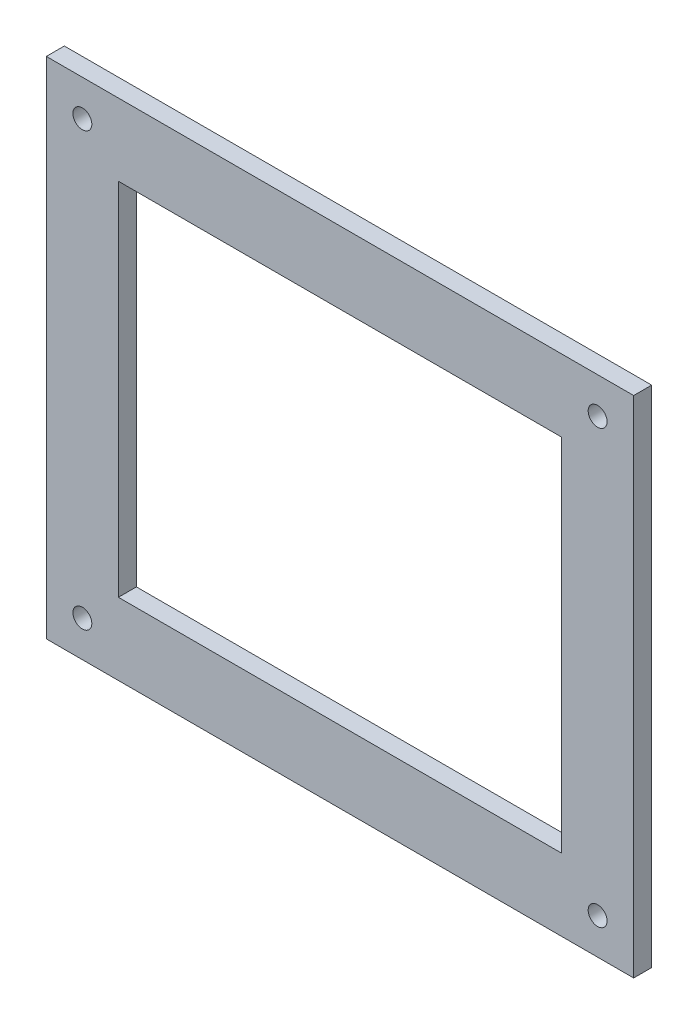
ISO-10303-21;
HEADER;
FILE_DESCRIPTION(('STEP AP214'),'2;1');
FILE_NAME('part.step','',(''),(''),'','','');
FILE_SCHEMA(('AUTOMOTIVE_DESIGN { 1 0 10303 214 1 1 1 1 }'));
ENDSEC;
DATA;
#1=APPLICATION_CONTEXT('core data for automotive mechanical design processes');
#2=APPLICATION_PROTOCOL_DEFINITION('international standard','automotive_design',2000,#1);
#3=PRODUCT_CONTEXT('',#1,'mechanical');
#4=PRODUCT('Part','Part','',(#3));
#5=PRODUCT_RELATED_PRODUCT_CATEGORY('part','',(#4));
#6=PRODUCT_DEFINITION_FORMATION('','',#4);
#7=PRODUCT_DEFINITION_CONTEXT('part definition',#1,'design');
#8=PRODUCT_DEFINITION('design','',#6,#7);
#9=PRODUCT_DEFINITION_SHAPE('','',#8);
#10=(LENGTH_UNIT() NAMED_UNIT(*) SI_UNIT(.MILLI.,.METRE.));
#11=(NAMED_UNIT(*) PLANE_ANGLE_UNIT() SI_UNIT($,.RADIAN.));
#12=(NAMED_UNIT(*) SI_UNIT($,.STERADIAN.) SOLID_ANGLE_UNIT());
#13=UNCERTAINTY_MEASURE_WITH_UNIT(LENGTH_MEASURE(1.E-05),#10,'distance_accuracy_value','');
#14=(GEOMETRIC_REPRESENTATION_CONTEXT(3) GLOBAL_UNCERTAINTY_ASSIGNED_CONTEXT((#13)) GLOBAL_UNIT_ASSIGNED_CONTEXT((#10,
#11,#12)) REPRESENTATION_CONTEXT('',''));
#15=CARTESIAN_POINT('',(0.,0.,0.));
#16=DIRECTION('',(0.,0.,1.));
#17=DIRECTION('',(1.,0.,0.));
#18=AXIS2_PLACEMENT_3D('',#15,#16,#17);
#19=CARTESIAN_POINT('',(0.,0.,10.));
#20=DIRECTION('',(0.,0.,-1.));
#21=DIRECTION('',(-1.,0.,0.));
#22=AXIS2_PLACEMENT_3D('',#19,#20,#21);
#23=PLANE('',#22);
#24=DIRECTION('',(0.,-1.,0.));
#25=VECTOR('',#24,1.);
#26=CARTESIAN_POINT('',(-40.,-40.,10.));
#27=LINE('',#26,#25);
#28=CARTESIAN_POINT('',(-40.,240.,10.));
#29=VERTEX_POINT('',#28);
#30=CARTESIAN_POINT('',(-40.,-40.,10.));
#31=VERTEX_POINT('',#30);
#32=EDGE_CURVE('E136',#29,#31,#27,.T.);
#33=ORIENTED_EDGE('',*,*,#32,.T.);
#34=DIRECTION('',(1.,0.,0.));
#35=VECTOR('',#34,1.);
#36=CARTESIAN_POINT('',(-40.,-40.,10.));
#37=LINE('',#36,#35);
#38=CARTESIAN_POINT('',(286.,-40.,10.));
#39=VERTEX_POINT('',#38);
#40=EDGE_CURVE('E139',#31,#39,#37,.T.);
#41=ORIENTED_EDGE('',*,*,#40,.T.);
#42=DIRECTION('',(0.,1.,0.));
#43=VECTOR('',#42,1.);
#44=CARTESIAN_POINT('',(286.,-40.,10.));
#45=LINE('',#44,#43);
#46=CARTESIAN_POINT('',(286.,240.,10.));
#47=VERTEX_POINT('',#46);
#48=EDGE_CURVE('E142',#39,#47,#45,.T.);
#49=ORIENTED_EDGE('',*,*,#48,.T.);
#50=DIRECTION('',(-1.,0.,0.));
#51=VECTOR('',#50,1.);
#52=CARTESIAN_POINT('',(-40.,240.,10.));
#53=LINE('',#52,#51);
#54=EDGE_CURVE('E144',#47,#29,#53,.T.);
#55=ORIENTED_EDGE('',*,*,#54,.T.);
#56=EDGE_LOOP('',(#33,#41,#49,#55));
#57=FACE_BOUND('',#56,.T.);
#58=DIRECTION('',(0.,-1.,0.));
#59=VECTOR('',#58,1.);
#60=CARTESIAN_POINT('',(0.,0.,10.));
#61=LINE('',#60,#59);
#62=CARTESIAN_POINT('',(0.,200.,10.));
#63=VERTEX_POINT('',#62);
#64=CARTESIAN_POINT('',(0.,0.,10.));
#65=VERTEX_POINT('',#64);
#66=EDGE_CURVE('E97',#63,#65,#61,.T.);
#67=ORIENTED_EDGE('',*,*,#66,.F.);
#68=DIRECTION('',(-1.,0.,0.));
#69=VECTOR('',#68,1.);
#70=CARTESIAN_POINT('',(0.,200.,10.));
#71=LINE('',#70,#69);
#72=CARTESIAN_POINT('',(246.,200.,10.));
#73=VERTEX_POINT('',#72);
#74=EDGE_CURVE('E120',#73,#63,#71,.T.);
#75=ORIENTED_EDGE('',*,*,#74,.F.);
#76=DIRECTION('',(0.,1.,0.));
#77=VECTOR('',#76,1.);
#78=CARTESIAN_POINT('',(246.,0.,10.));
#79=LINE('',#78,#77);
#80=CARTESIAN_POINT('',(246.,0.,10.));
#81=VERTEX_POINT('',#80);
#82=EDGE_CURVE('E118',#81,#73,#79,.T.);
#83=ORIENTED_EDGE('',*,*,#82,.F.);
#84=DIRECTION('',(1.,0.,0.));
#85=VECTOR('',#84,1.);
#86=CARTESIAN_POINT('',(0.,0.,10.));
#87=LINE('',#86,#85);
#88=EDGE_CURVE('E105',#65,#81,#87,.T.);
#89=ORIENTED_EDGE('',*,*,#88,.F.);
#90=EDGE_LOOP('',(#67,#75,#83,#89));
#91=FACE_BOUND('',#90,.T.);
#92=CARTESIAN_POINT('',(-20.,220.,10.));
#93=DIRECTION('',(0.,0.,1.));
#94=DIRECTION('',(1.,0.,0.));
#95=AXIS2_PLACEMENT_3D('',#92,#93,#94);
#96=CIRCLE('',#95,5.25);
#97=CARTESIAN_POINT('',(-14.75,220.,10.));
#98=VERTEX_POINT('',#97);
#99=EDGE_CURVE('E126',#98,#98,#96,.T.);
#100=ORIENTED_EDGE('',*,*,#99,.F.);
#101=EDGE_LOOP('',(#100));
#102=FACE_BOUND('',#101,.T.);
#103=CARTESIAN_POINT('',(266.,220.,10.));
#104=DIRECTION('',(0.,0.,1.));
#105=DIRECTION('',(1.,0.,0.));
#106=AXIS2_PLACEMENT_3D('',#103,#104,#105);
#107=CIRCLE('',#106,5.25);
#108=CARTESIAN_POINT('',(271.25,220.,10.));
#109=VERTEX_POINT('',#108);
#110=EDGE_CURVE('E248',#109,#109,#107,.T.);
#111=ORIENTED_EDGE('',*,*,#110,.F.);
#112=EDGE_LOOP('',(#111));
#113=FACE_BOUND('',#112,.T.);
#114=CARTESIAN_POINT('',(266.,-20.,10.));
#115=DIRECTION('',(0.,0.,1.));
#116=DIRECTION('',(1.,0.,0.));
#117=AXIS2_PLACEMENT_3D('',#114,#115,#116);
#118=CIRCLE('',#117,5.25);
#119=CARTESIAN_POINT('',(271.25,-20.,10.));
#120=VERTEX_POINT('',#119);
#121=EDGE_CURVE('E242',#120,#120,#118,.T.);
#122=ORIENTED_EDGE('',*,*,#121,.F.);
#123=EDGE_LOOP('',(#122));
#124=FACE_BOUND('',#123,.T.);
#125=CARTESIAN_POINT('',(-20.,-20.,10.));
#126=DIRECTION('',(0.,0.,1.));
#127=DIRECTION('',(1.,0.,0.));
#128=AXIS2_PLACEMENT_3D('',#125,#126,#127);
#129=CIRCLE('',#128,5.25);
#130=CARTESIAN_POINT('',(-14.75,-20.,10.));
#131=VERTEX_POINT('',#130);
#132=EDGE_CURVE('E233',#131,#131,#129,.T.);
#133=ORIENTED_EDGE('',*,*,#132,.F.);
#134=EDGE_LOOP('',(#133));
#135=FACE_BOUND('',#134,.T.);
#136=ADVANCED_FACE('F32',(#57,#91,#102,#113,#124,#135),#23,.F.);
#137=CARTESIAN_POINT('',(0.,0.,0.));
#138=DIRECTION('',(0.,0.,-1.));
#139=DIRECTION('',(-1.,0.,0.));
#140=AXIS2_PLACEMENT_3D('',#137,#138,#139);
#141=PLANE('',#140);
#142=CARTESIAN_POINT('',(266.,-20.,0.));
#143=DIRECTION('',(0.,0.,1.));
#144=DIRECTION('',(1.,0.,0.));
#145=AXIS2_PLACEMENT_3D('',#142,#143,#144);
#146=CIRCLE('',#145,5.25);
#147=CARTESIAN_POINT('',(271.25,-20.,0.));
#148=VERTEX_POINT('',#147);
#149=EDGE_CURVE('E239',#148,#148,#146,.T.);
#150=ORIENTED_EDGE('',*,*,#149,.T.);
#151=EDGE_LOOP('',(#150));
#152=FACE_BOUND('',#151,.T.);
#153=CARTESIAN_POINT('',(-20.,220.,0.));
#154=DIRECTION('',(0.,0.,1.));
#155=DIRECTION('',(1.,0.,0.));
#156=AXIS2_PLACEMENT_3D('',#153,#154,#155);
#157=CIRCLE('',#156,5.25);
#158=CARTESIAN_POINT('',(-14.75,220.,0.));
#159=VERTEX_POINT('',#158);
#160=EDGE_CURVE('E251',#159,#159,#157,.T.);
#161=ORIENTED_EDGE('',*,*,#160,.T.);
#162=EDGE_LOOP('',(#161));
#163=FACE_BOUND('',#162,.T.);
#164=DIRECTION('',(0.,-1.,0.));
#165=VECTOR('',#164,1.);
#166=CARTESIAN_POINT('',(-40.,-40.,0.));
#167=LINE('',#166,#165);
#168=CARTESIAN_POINT('',(-40.,240.,0.));
#169=VERTEX_POINT('',#168);
#170=CARTESIAN_POINT('',(-40.,-40.,0.));
#171=VERTEX_POINT('',#170);
#172=EDGE_CURVE('E113',#169,#171,#167,.T.);
#173=ORIENTED_EDGE('',*,*,#172,.F.);
#174=DIRECTION('',(-1.,0.,0.));
#175=VECTOR('',#174,1.);
#176=CARTESIAN_POINT('',(-40.,240.,0.));
#177=LINE('',#176,#175);
#178=CARTESIAN_POINT('',(286.,240.,0.));
#179=VERTEX_POINT('',#178);
#180=EDGE_CURVE('E140',#179,#169,#177,.T.);
#181=ORIENTED_EDGE('',*,*,#180,.F.);
#182=DIRECTION('',(0.,1.,0.));
#183=VECTOR('',#182,1.);
#184=CARTESIAN_POINT('',(286.,-40.,0.));
#185=LINE('',#184,#183);
#186=CARTESIAN_POINT('',(286.,-40.,0.));
#187=VERTEX_POINT('',#186);
#188=EDGE_CURVE('E151',#187,#179,#185,.T.);
#189=ORIENTED_EDGE('',*,*,#188,.F.);
#190=DIRECTION('',(1.,0.,0.));
#191=VECTOR('',#190,1.);
#192=CARTESIAN_POINT('',(-40.,-40.,0.));
#193=LINE('',#192,#191);
#194=EDGE_CURVE('E149',#171,#187,#193,.T.);
#195=ORIENTED_EDGE('',*,*,#194,.F.);
#196=EDGE_LOOP('',(#173,#181,#189,#195));
#197=FACE_BOUND('',#196,.T.);
#198=DIRECTION('',(-1.,0.,0.));
#199=VECTOR('',#198,1.);
#200=CARTESIAN_POINT('',(0.,200.,0.));
#201=LINE('',#200,#199);
#202=CARTESIAN_POINT('',(246.,200.,0.));
#203=VERTEX_POINT('',#202);
#204=CARTESIAN_POINT('',(0.,200.,0.));
#205=VERTEX_POINT('',#204);
#206=EDGE_CURVE('E106',#203,#205,#201,.T.);
#207=ORIENTED_EDGE('',*,*,#206,.T.);
#208=DIRECTION('',(0.,-1.,0.));
#209=VECTOR('',#208,1.);
#210=CARTESIAN_POINT('',(0.,0.,0.));
#211=LINE('',#210,#209);
#212=CARTESIAN_POINT('',(0.,0.,0.));
#213=VERTEX_POINT('',#212);
#214=EDGE_CURVE('E55',#205,#213,#211,.T.);
#215=ORIENTED_EDGE('',*,*,#214,.T.);
#216=DIRECTION('',(1.,0.,0.));
#217=VECTOR('',#216,1.);
#218=CARTESIAN_POINT('',(0.,0.,0.));
#219=LINE('',#218,#217);
#220=CARTESIAN_POINT('',(246.,0.,0.));
#221=VERTEX_POINT('',#220);
#222=EDGE_CURVE('E112',#213,#221,#219,.T.);
#223=ORIENTED_EDGE('',*,*,#222,.T.);
#224=DIRECTION('',(0.,1.,0.));
#225=VECTOR('',#224,1.);
#226=CARTESIAN_POINT('',(246.,0.,0.));
#227=LINE('',#226,#225);
#228=EDGE_CURVE('E128',#221,#203,#227,.T.);
#229=ORIENTED_EDGE('',*,*,#228,.T.);
#230=EDGE_LOOP('',(#207,#215,#223,#229));
#231=FACE_BOUND('',#230,.T.);
#232=CARTESIAN_POINT('',(266.,220.,0.));
#233=DIRECTION('',(0.,0.,1.));
#234=DIRECTION('',(1.,0.,0.));
#235=AXIS2_PLACEMENT_3D('',#232,#233,#234);
#236=CIRCLE('',#235,5.25);
#237=CARTESIAN_POINT('',(271.25,220.,0.));
#238=VERTEX_POINT('',#237);
#239=EDGE_CURVE('E245',#238,#238,#236,.T.);
#240=ORIENTED_EDGE('',*,*,#239,.T.);
#241=EDGE_LOOP('',(#240));
#242=FACE_BOUND('',#241,.T.);
#243=CARTESIAN_POINT('',(-20.,-20.,0.));
#244=DIRECTION('',(0.,0.,1.));
#245=DIRECTION('',(1.,0.,0.));
#246=AXIS2_PLACEMENT_3D('',#243,#244,#245);
#247=CIRCLE('',#246,5.25);
#248=CARTESIAN_POINT('',(-14.75,-20.,0.));
#249=VERTEX_POINT('',#248);
#250=EDGE_CURVE('E236',#249,#249,#247,.T.);
#251=ORIENTED_EDGE('',*,*,#250,.T.);
#252=EDGE_LOOP('',(#251));
#253=FACE_BOUND('',#252,.T.);
#254=ADVANCED_FACE('F169',(#152,#163,#197,#231,#242,#253),#141,.T.);
#255=CARTESIAN_POINT('',(-40.,-40.,10.));
#256=DIRECTION('',(1.,0.,0.));
#257=DIRECTION('',(0.,0.,-1.));
#258=AXIS2_PLACEMENT_3D('',#255,#256,#257);
#259=PLANE('',#258);
#260=ORIENTED_EDGE('',*,*,#172,.T.);
#261=DIRECTION('',(0.,0.,-1.));
#262=VECTOR('',#261,1.);
#263=CARTESIAN_POINT('',(-40.,-40.,10.));
#264=LINE('',#263,#262);
#265=EDGE_CURVE('E11',#31,#171,#264,.T.);
#266=ORIENTED_EDGE('',*,*,#265,.F.);
#267=ORIENTED_EDGE('',*,*,#32,.F.);
#268=DIRECTION('',(0.,0.,-1.));
#269=VECTOR('',#268,1.);
#270=CARTESIAN_POINT('',(-40.,240.,10.));
#271=LINE('',#270,#269);
#272=EDGE_CURVE('E146',#29,#169,#271,.T.);
#273=ORIENTED_EDGE('',*,*,#272,.T.);
#274=EDGE_LOOP('',(#260,#266,#267,#273));
#275=FACE_BOUND('',#274,.T.);
#276=ADVANCED_FACE('F34',(#275),#259,.F.);
#277=CARTESIAN_POINT('',(-40.,-40.,10.));
#278=DIRECTION('',(0.,1.,0.));
#279=DIRECTION('',(0.,0.,1.));
#280=AXIS2_PLACEMENT_3D('',#277,#278,#279);
#281=PLANE('',#280);
#282=ORIENTED_EDGE('',*,*,#194,.T.);
#283=DIRECTION('',(0.,0.,-1.));
#284=VECTOR('',#283,1.);
#285=CARTESIAN_POINT('',(286.,-40.,10.));
#286=LINE('',#285,#284);
#287=EDGE_CURVE('E40',#39,#187,#286,.T.);
#288=ORIENTED_EDGE('',*,*,#287,.F.);
#289=ORIENTED_EDGE('',*,*,#40,.F.);
#290=ORIENTED_EDGE('',*,*,#265,.T.);
#291=EDGE_LOOP('',(#282,#288,#289,#290));
#292=FACE_BOUND('',#291,.T.);
#293=ADVANCED_FACE('F179',(#292),#281,.F.);
#294=CARTESIAN_POINT('',(286.,-40.,10.));
#295=DIRECTION('',(-1.,0.,0.));
#296=DIRECTION('',(0.,-1.,0.));
#297=AXIS2_PLACEMENT_3D('',#294,#295,#296);
#298=PLANE('',#297);
#299=ORIENTED_EDGE('',*,*,#188,.T.);
#300=DIRECTION('',(0.,0.,-1.));
#301=VECTOR('',#300,1.);
#302=CARTESIAN_POINT('',(286.,240.,10.));
#303=LINE('',#302,#301);
#304=EDGE_CURVE('E156',#47,#179,#303,.T.);
#305=ORIENTED_EDGE('',*,*,#304,.F.);
#306=ORIENTED_EDGE('',*,*,#48,.F.);
#307=ORIENTED_EDGE('',*,*,#287,.T.);
#308=EDGE_LOOP('',(#299,#305,#306,#307));
#309=FACE_BOUND('',#308,.T.);
#310=ADVANCED_FACE('F163',(#309),#298,.F.);
#311=CARTESIAN_POINT('',(-40.,240.,10.));
#312=DIRECTION('',(0.,-1.,0.));
#313=DIRECTION('',(0.,0.,-1.));
#314=AXIS2_PLACEMENT_3D('',#311,#312,#313);
#315=PLANE('',#314);
#316=ORIENTED_EDGE('',*,*,#180,.T.);
#317=ORIENTED_EDGE('',*,*,#272,.F.);
#318=ORIENTED_EDGE('',*,*,#54,.F.);
#319=ORIENTED_EDGE('',*,*,#304,.T.);
#320=EDGE_LOOP('',(#316,#317,#318,#319));
#321=FACE_BOUND('',#320,.T.);
#322=ADVANCED_FACE('F173',(#321),#315,.F.);
#323=CARTESIAN_POINT('',(0.,0.,10.));
#324=DIRECTION('',(1.,0.,0.));
#325=DIRECTION('',(0.,0.,-1.));
#326=AXIS2_PLACEMENT_3D('',#323,#324,#325);
#327=PLANE('',#326);
#328=ORIENTED_EDGE('',*,*,#214,.F.);
#329=DIRECTION('',(0.,0.,-1.));
#330=VECTOR('',#329,1.);
#331=CARTESIAN_POINT('',(0.,200.,10.));
#332=LINE('',#331,#330);
#333=EDGE_CURVE('E101',#63,#205,#332,.T.);
#334=ORIENTED_EDGE('',*,*,#333,.F.);
#335=ORIENTED_EDGE('',*,*,#66,.T.);
#336=DIRECTION('',(0.,0.,-1.));
#337=VECTOR('',#336,1.);
#338=CARTESIAN_POINT('',(0.,0.,10.));
#339=LINE('',#338,#337);
#340=EDGE_CURVE('E100',#65,#213,#339,.T.);
#341=ORIENTED_EDGE('',*,*,#340,.T.);
#342=EDGE_LOOP('',(#328,#334,#335,#341));
#343=FACE_BOUND('',#342,.T.);
#344=ADVANCED_FACE('F99',(#343),#327,.T.);
#345=CARTESIAN_POINT('',(0.,0.,10.));
#346=DIRECTION('',(0.,1.,0.));
#347=DIRECTION('',(0.,0.,1.));
#348=AXIS2_PLACEMENT_3D('',#345,#346,#347);
#349=PLANE('',#348);
#350=ORIENTED_EDGE('',*,*,#222,.F.);
#351=ORIENTED_EDGE('',*,*,#340,.F.);
#352=ORIENTED_EDGE('',*,*,#88,.T.);
#353=DIRECTION('',(0.,0.,-1.));
#354=VECTOR('',#353,1.);
#355=CARTESIAN_POINT('',(246.,0.,10.));
#356=LINE('',#355,#354);
#357=EDGE_CURVE('E114',#81,#221,#356,.T.);
#358=ORIENTED_EDGE('',*,*,#357,.T.);
#359=EDGE_LOOP('',(#350,#351,#352,#358));
#360=FACE_BOUND('',#359,.T.);
#361=ADVANCED_FACE('F109',(#360),#349,.T.);
#362=CARTESIAN_POINT('',(246.,0.,10.));
#363=DIRECTION('',(-1.,0.,0.));
#364=DIRECTION('',(0.,0.,1.));
#365=AXIS2_PLACEMENT_3D('',#362,#363,#364);
#366=PLANE('',#365);
#367=ORIENTED_EDGE('',*,*,#228,.F.);
#368=ORIENTED_EDGE('',*,*,#357,.F.);
#369=ORIENTED_EDGE('',*,*,#82,.T.);
#370=DIRECTION('',(0.,0.,-1.));
#371=VECTOR('',#370,1.);
#372=CARTESIAN_POINT('',(246.,200.,10.));
#373=LINE('',#372,#371);
#374=EDGE_CURVE('E47',#73,#203,#373,.T.);
#375=ORIENTED_EDGE('',*,*,#374,.T.);
#376=EDGE_LOOP('',(#367,#368,#369,#375));
#377=FACE_BOUND('',#376,.T.);
#378=ADVANCED_FACE('F203',(#377),#366,.T.);
#379=CARTESIAN_POINT('',(0.,200.,10.));
#380=DIRECTION('',(0.,-1.,0.));
#381=DIRECTION('',(0.,0.,-1.));
#382=AXIS2_PLACEMENT_3D('',#379,#380,#381);
#383=PLANE('',#382);
#384=ORIENTED_EDGE('',*,*,#206,.F.);
#385=ORIENTED_EDGE('',*,*,#374,.F.);
#386=ORIENTED_EDGE('',*,*,#74,.T.);
#387=ORIENTED_EDGE('',*,*,#333,.T.);
#388=EDGE_LOOP('',(#384,#385,#386,#387));
#389=FACE_BOUND('',#388,.T.);
#390=ADVANCED_FACE('F207',(#389),#383,.T.);
#391=CARTESIAN_POINT('',(-20.,220.,10.));
#392=DIRECTION('',(0.,0.,-1.));
#393=DIRECTION('',(-1.,0.,0.));
#394=AXIS2_PLACEMENT_3D('',#391,#392,#393);
#395=CYLINDRICAL_SURFACE('',#394,5.25);
#396=ORIENTED_EDGE('',*,*,#99,.T.);
#397=EDGE_LOOP('',(#396));
#398=FACE_BOUND('',#397,.T.);
#399=ORIENTED_EDGE('',*,*,#160,.F.);
#400=EDGE_LOOP('',(#399));
#401=FACE_BOUND('',#400,.T.);
#402=ADVANCED_FACE('F213',(#398,#401),#395,.F.);
#403=CARTESIAN_POINT('',(266.,220.,10.));
#404=DIRECTION('',(0.,0.,-1.));
#405=DIRECTION('',(-1.,0.,0.));
#406=AXIS2_PLACEMENT_3D('',#403,#404,#405);
#407=CYLINDRICAL_SURFACE('',#406,5.25);
#408=ORIENTED_EDGE('',*,*,#110,.T.);
#409=EDGE_LOOP('',(#408));
#410=FACE_BOUND('',#409,.T.);
#411=ORIENTED_EDGE('',*,*,#239,.F.);
#412=EDGE_LOOP('',(#411));
#413=FACE_BOUND('',#412,.T.);
#414=ADVANCED_FACE('F216',(#410,#413),#407,.F.);
#415=CARTESIAN_POINT('',(266.,-20.,10.));
#416=DIRECTION('',(0.,0.,-1.));
#417=DIRECTION('',(-1.,0.,0.));
#418=AXIS2_PLACEMENT_3D('',#415,#416,#417);
#419=CYLINDRICAL_SURFACE('',#418,5.25);
#420=ORIENTED_EDGE('',*,*,#121,.T.);
#421=EDGE_LOOP('',(#420));
#422=FACE_BOUND('',#421,.T.);
#423=ORIENTED_EDGE('',*,*,#149,.F.);
#424=EDGE_LOOP('',(#423));
#425=FACE_BOUND('',#424,.T.);
#426=ADVANCED_FACE('F220',(#422,#425),#419,.F.);
#427=CARTESIAN_POINT('',(-20.,-20.,10.));
#428=DIRECTION('',(0.,0.,-1.));
#429=DIRECTION('',(-1.,0.,0.));
#430=AXIS2_PLACEMENT_3D('',#427,#428,#429);
#431=CYLINDRICAL_SURFACE('',#430,5.25);
#432=ORIENTED_EDGE('',*,*,#132,.T.);
#433=EDGE_LOOP('',(#432));
#434=FACE_BOUND('',#433,.T.);
#435=ORIENTED_EDGE('',*,*,#250,.F.);
#436=EDGE_LOOP('',(#435));
#437=FACE_BOUND('',#436,.T.);
#438=ADVANCED_FACE('F224',(#434,#437),#431,.F.);
#439=CLOSED_SHELL('',(#136,#254,#276,#293,#310,#322,#344,#361,#378,#390,#402,#414,#426,#438));
#440=MANIFOLD_SOLID_BREP('B2',#439);
#441=ADVANCED_BREP_SHAPE_REPRESENTATION('',(#18,#440),#14);
#442=SHAPE_DEFINITION_REPRESENTATION(#9,#441);
ENDSEC;
END-ISO-10303-21;
